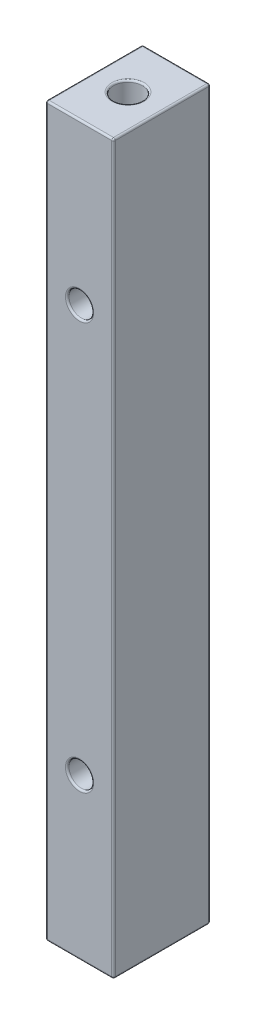
ISO-10303-21;
HEADER;
FILE_DESCRIPTION(('STEP AP214'),'2;1');
FILE_NAME('part.step','',(''),(''),'','','');
FILE_SCHEMA(('AUTOMOTIVE_DESIGN { 1 0 10303 214 1 1 1 1 }'));
ENDSEC;
DATA;
#1=APPLICATION_CONTEXT('core data for automotive mechanical design processes');
#2=APPLICATION_PROTOCOL_DEFINITION('international standard','automotive_design',2000,#1);
#3=PRODUCT_CONTEXT('',#1,'mechanical');
#4=PRODUCT('Part','Part','',(#3));
#5=PRODUCT_RELATED_PRODUCT_CATEGORY('part','',(#4));
#6=PRODUCT_DEFINITION_FORMATION('','',#4);
#7=PRODUCT_DEFINITION_CONTEXT('part definition',#1,'design');
#8=PRODUCT_DEFINITION('design','',#6,#7);
#9=PRODUCT_DEFINITION_SHAPE('','',#8);
#10=(LENGTH_UNIT() NAMED_UNIT(*) SI_UNIT(.MILLI.,.METRE.));
#11=(NAMED_UNIT(*) PLANE_ANGLE_UNIT() SI_UNIT($,.RADIAN.));
#12=(NAMED_UNIT(*) SI_UNIT($,.STERADIAN.) SOLID_ANGLE_UNIT());
#13=UNCERTAINTY_MEASURE_WITH_UNIT(LENGTH_MEASURE(1.E-05),#10,'distance_accuracy_value','');
#14=(GEOMETRIC_REPRESENTATION_CONTEXT(3) GLOBAL_UNCERTAINTY_ASSIGNED_CONTEXT((#13)) GLOBAL_UNIT_ASSIGNED_CONTEXT((#10,
#11,#12)) REPRESENTATION_CONTEXT('',''));
#15=CARTESIAN_POINT('',(0.,0.,0.));
#16=DIRECTION('',(0.,0.,1.));
#17=DIRECTION('',(1.,0.,0.));
#18=AXIS2_PLACEMENT_3D('',#15,#16,#17);
#19=CARTESIAN_POINT('',(0.,51.054,0.));
#20=DIRECTION('',(0.,-1.,0.));
#21=DIRECTION('',(0.,0.,-1.));
#22=AXIS2_PLACEMENT_3D('',#19,#20,#21);
#23=CYLINDRICAL_SURFACE('',#22,2.0193);
#24=CARTESIAN_POINT('',(0.,-50.8,0.));
#25=DIRECTION('',(0.,1.,0.));
#26=DIRECTION('',(0.,0.,1.));
#27=AXIS2_PLACEMENT_3D('',#24,#25,#26);
#28=CIRCLE('',#27,2.0193);
#29=CARTESIAN_POINT('',(0.,-50.8,2.0193));
#30=VERTEX_POINT('',#29);
#31=EDGE_CURVE('E44',#30,#30,#28,.F.);
#32=ORIENTED_EDGE('',*,*,#31,.T.);
#33=EDGE_LOOP('',(#32));
#34=FACE_BOUND('',#33,.T.);
#35=CARTESIAN_POINT('',(0.,-38.354,0.));
#36=DIRECTION('',(0.,1.,0.));
#37=DIRECTION('',(0.,0.,1.));
#38=AXIS2_PLACEMENT_3D('',#35,#36,#37);
#39=CIRCLE('',#38,2.0193);
#40=CARTESIAN_POINT('',(0.,-38.354,2.0193));
#41=VERTEX_POINT('',#40);
#42=EDGE_CURVE('E294',#41,#41,#39,.F.);
#43=ORIENTED_EDGE('',*,*,#42,.F.);
#44=EDGE_LOOP('',(#43));
#45=FACE_BOUND('',#44,.T.);
#46=ADVANCED_FACE('F35',(#34,#45),#23,.F.);
#47=CARTESIAN_POINT('',(0.,51.054,0.));
#48=DIRECTION('',(0.,1.,0.));
#49=DIRECTION('',(0.,0.,1.));
#50=AXIS2_PLACEMENT_3D('',#47,#48,#49);
#51=PLANE('',#50);
#52=DIRECTION('',(0.,0.,1.));
#53=VECTOR('',#52,1.);
#54=CARTESIAN_POINT('',(-4.5085,51.054,6.79958));
#55=LINE('',#54,#53);
#56=CARTESIAN_POINT('',(-4.5085,51.054,-6.54558));
#57=VERTEX_POINT('',#56);
#58=CARTESIAN_POINT('',(-4.5085,51.054,6.54558));
#59=VERTEX_POINT('',#58);
#60=EDGE_CURVE('E137',#57,#59,#55,.T.);
#61=ORIENTED_EDGE('',*,*,#60,.T.);
#62=DIRECTION('',(1.,0.,0.));
#63=VECTOR('',#62,1.);
#64=CARTESIAN_POINT('',(4.7625,51.054,6.54558));
#65=LINE('',#64,#63);
#66=CARTESIAN_POINT('',(4.5085,51.054,6.54558));
#67=VERTEX_POINT('',#66);
#68=EDGE_CURVE('E133',#59,#67,#65,.T.);
#69=ORIENTED_EDGE('',*,*,#68,.T.);
#70=DIRECTION('',(0.,0.,-1.));
#71=VECTOR('',#70,1.);
#72=CARTESIAN_POINT('',(4.5085,51.054,-6.79958));
#73=LINE('',#72,#71);
#74=CARTESIAN_POINT('',(4.5085,51.054,-6.54558));
#75=VERTEX_POINT('',#74);
#76=EDGE_CURVE('E124',#67,#75,#73,.T.);
#77=ORIENTED_EDGE('',*,*,#76,.T.);
#78=DIRECTION('',(-1.,0.,0.));
#79=VECTOR('',#78,1.);
#80=CARTESIAN_POINT('',(-4.7625,51.054,-6.54558));
#81=LINE('',#80,#79);
#82=EDGE_CURVE('E130',#75,#57,#81,.T.);
#83=ORIENTED_EDGE('',*,*,#82,.T.);
#84=EDGE_LOOP('',(#61,#69,#77,#83));
#85=FACE_BOUND('',#84,.T.);
#86=CARTESIAN_POINT('',(0.,51.054,0.));
#87=DIRECTION('',(0.,1.,0.));
#88=DIRECTION('',(0.,0.,1.));
#89=AXIS2_PLACEMENT_3D('',#86,#87,#88);
#90=CIRCLE('',#89,2.2733);
#91=CARTESIAN_POINT('',(0.,51.054,2.2733));
#92=VERTEX_POINT('',#91);
#93=EDGE_CURVE('E163',#92,#92,#90,.F.);
#94=ORIENTED_EDGE('',*,*,#93,.T.);
#95=EDGE_LOOP('',(#94));
#96=FACE_BOUND('',#95,.T.);
#97=ADVANCED_FACE('F127',(#85,#96),#51,.T.);
#98=CARTESIAN_POINT('',(0.,-51.054,0.));
#99=DIRECTION('',(0.,1.,0.));
#100=DIRECTION('',(0.,0.,1.));
#101=AXIS2_PLACEMENT_3D('',#98,#99,#100);
#102=PLANE('',#101);
#103=DIRECTION('',(0.,0.,-1.));
#104=VECTOR('',#103,1.);
#105=CARTESIAN_POINT('',(4.5085,-51.054,0.));
#106=LINE('',#105,#104);
#107=CARTESIAN_POINT('',(4.5085,-51.054,-6.54558));
#108=VERTEX_POINT('',#107);
#109=CARTESIAN_POINT('',(4.5085,-51.054,6.54558));
#110=VERTEX_POINT('',#109);
#111=EDGE_CURVE('E186',#108,#110,#106,.F.);
#112=ORIENTED_EDGE('',*,*,#111,.T.);
#113=DIRECTION('',(1.,0.,0.));
#114=VECTOR('',#113,1.);
#115=CARTESIAN_POINT('',(0.,-51.054,6.54558));
#116=LINE('',#115,#114);
#117=CARTESIAN_POINT('',(-4.5085,-51.054,6.54558));
#118=VERTEX_POINT('',#117);
#119=EDGE_CURVE('E191',#110,#118,#116,.F.);
#120=ORIENTED_EDGE('',*,*,#119,.T.);
#121=DIRECTION('',(0.,0.,1.));
#122=VECTOR('',#121,1.);
#123=CARTESIAN_POINT('',(-4.5085,-51.054,0.));
#124=LINE('',#123,#122);
#125=CARTESIAN_POINT('',(-4.5085,-51.054,-6.54558));
#126=VERTEX_POINT('',#125);
#127=EDGE_CURVE('E188',#118,#126,#124,.F.);
#128=ORIENTED_EDGE('',*,*,#127,.T.);
#129=DIRECTION('',(-1.,0.,0.));
#130=VECTOR('',#129,1.);
#131=CARTESIAN_POINT('',(0.,-51.054,-6.54558));
#132=LINE('',#131,#130);
#133=EDGE_CURVE('E184',#126,#108,#132,.F.);
#134=ORIENTED_EDGE('',*,*,#133,.T.);
#135=EDGE_LOOP('',(#112,#120,#128,#134));
#136=FACE_BOUND('',#135,.T.);
#137=CARTESIAN_POINT('',(0.,-51.054,0.));
#138=DIRECTION('',(0.,1.,0.));
#139=DIRECTION('',(0.,0.,1.));
#140=AXIS2_PLACEMENT_3D('',#137,#138,#139);
#141=CIRCLE('',#140,2.2733);
#142=CARTESIAN_POINT('',(0.,-51.054,2.2733));
#143=VERTEX_POINT('',#142);
#144=EDGE_CURVE('E181',#143,#143,#141,.T.);
#145=ORIENTED_EDGE('',*,*,#144,.T.);
#146=EDGE_LOOP('',(#145));
#147=FACE_BOUND('',#146,.T.);
#148=ADVANCED_FACE('F329',(#136,#147),#102,.F.);
#149=CARTESIAN_POINT('',(4.7625,51.054,6.79958));
#150=DIRECTION('',(-1.,0.,0.));
#151=DIRECTION('',(0.,0.,1.));
#152=AXIS2_PLACEMENT_3D('',#149,#150,#151);
#153=PLANE('',#152);
#154=DIRECTION('',(0.,0.,-1.));
#155=VECTOR('',#154,1.);
#156=CARTESIAN_POINT('',(4.7625,50.8,6.79958));
#157=LINE('',#156,#155);
#158=CARTESIAN_POINT('',(4.7625,50.8,-6.54558));
#159=VERTEX_POINT('',#158);
#160=CARTESIAN_POINT('',(4.7625,50.8,6.54558));
#161=VERTEX_POINT('',#160);
#162=EDGE_CURVE('E145',#159,#161,#157,.F.);
#163=ORIENTED_EDGE('',*,*,#162,.T.);
#164=DIRECTION('',(0.,-1.,0.));
#165=VECTOR('',#164,1.);
#166=CARTESIAN_POINT('',(4.7625,51.054,6.54558));
#167=LINE('',#166,#165);
#168=CARTESIAN_POINT('',(4.7625,-50.8,6.54558));
#169=VERTEX_POINT('',#168);
#170=EDGE_CURVE('E198',#161,#169,#167,.T.);
#171=ORIENTED_EDGE('',*,*,#170,.T.);
#172=DIRECTION('',(0.,0.,-1.));
#173=VECTOR('',#172,1.);
#174=CARTESIAN_POINT('',(4.7625,-50.8,6.79958));
#175=LINE('',#174,#173);
#176=CARTESIAN_POINT('',(4.7625,-50.8,-6.54558));
#177=VERTEX_POINT('',#176);
#178=EDGE_CURVE('E195',#169,#177,#175,.T.);
#179=ORIENTED_EDGE('',*,*,#178,.T.);
#180=DIRECTION('',(0.,-1.,0.));
#181=VECTOR('',#180,1.);
#182=CARTESIAN_POINT('',(4.7625,51.054,-6.54558));
#183=LINE('',#182,#181);
#184=EDGE_CURVE('E193',#177,#159,#183,.F.);
#185=ORIENTED_EDGE('',*,*,#184,.T.);
#186=EDGE_LOOP('',(#163,#171,#179,#185));
#187=FACE_BOUND('',#186,.T.);
#188=ADVANCED_FACE('F340',(#187),#153,.F.);
#189=CARTESIAN_POINT('',(4.7625,51.054,-6.79958));
#190=DIRECTION('',(0.,0.,1.));
#191=DIRECTION('',(1.,0.,0.));
#192=AXIS2_PLACEMENT_3D('',#189,#190,#191);
#193=PLANE('',#192);
#194=DIRECTION('',(-1.,0.,0.));
#195=VECTOR('',#194,1.);
#196=CARTESIAN_POINT('',(4.7625,50.8,-6.79958));
#197=LINE('',#196,#195);
#198=CARTESIAN_POINT('',(-4.5085,50.8,-6.79958));
#199=VERTEX_POINT('',#198);
#200=CARTESIAN_POINT('',(4.5085,50.8,-6.79958));
#201=VERTEX_POINT('',#200);
#202=EDGE_CURVE('E52',#199,#201,#197,.F.);
#203=ORIENTED_EDGE('',*,*,#202,.T.);
#204=DIRECTION('',(0.,-1.,0.));
#205=VECTOR('',#204,1.);
#206=CARTESIAN_POINT('',(4.5085,51.054,-6.79958));
#207=LINE('',#206,#205);
#208=CARTESIAN_POINT('',(4.5085,-50.8,-6.79958));
#209=VERTEX_POINT('',#208);
#210=EDGE_CURVE('E237',#201,#209,#207,.T.);
#211=ORIENTED_EDGE('',*,*,#210,.T.);
#212=DIRECTION('',(-1.,0.,0.));
#213=VECTOR('',#212,1.);
#214=CARTESIAN_POINT('',(4.7625,-50.8,-6.79958));
#215=LINE('',#214,#213);
#216=CARTESIAN_POINT('',(-4.5085,-50.8,-6.79958));
#217=VERTEX_POINT('',#216);
#218=EDGE_CURVE('E233',#209,#217,#215,.T.);
#219=ORIENTED_EDGE('',*,*,#218,.T.);
#220=DIRECTION('',(0.,-1.,0.));
#221=VECTOR('',#220,1.);
#222=CARTESIAN_POINT('',(-4.5085,51.054,-6.79958));
#223=LINE('',#222,#221);
#224=EDGE_CURVE('E57',#217,#199,#223,.F.);
#225=ORIENTED_EDGE('',*,*,#224,.T.);
#226=EDGE_LOOP('',(#203,#211,#219,#225));
#227=FACE_BOUND('',#226,.T.);
#228=CARTESIAN_POINT('',(0.,-28.575,-6.79958));
#229=DIRECTION('',(0.,0.,1.));
#230=DIRECTION('',(1.,0.,0.));
#231=AXIS2_PLACEMENT_3D('',#228,#229,#230);
#232=CIRCLE('',#231,1.9812);
#233=CARTESIAN_POINT('',(1.9812,-28.575,-6.79958));
#234=VERTEX_POINT('',#233);
#235=EDGE_CURVE('E230',#234,#234,#232,.T.);
#236=ORIENTED_EDGE('',*,*,#235,.T.);
#237=EDGE_LOOP('',(#236));
#238=FACE_BOUND('',#237,.T.);
#239=CARTESIAN_POINT('',(0.,28.575,-6.79958));
#240=DIRECTION('',(0.,0.,1.));
#241=DIRECTION('',(1.,0.,0.));
#242=AXIS2_PLACEMENT_3D('',#239,#240,#241);
#243=CIRCLE('',#242,1.9812);
#244=CARTESIAN_POINT('',(1.98120000000001,28.575,-6.79958));
#245=VERTEX_POINT('',#244);
#246=EDGE_CURVE('E227',#245,#245,#243,.T.);
#247=ORIENTED_EDGE('',*,*,#246,.T.);
#248=EDGE_LOOP('',(#247));
#249=FACE_BOUND('',#248,.T.);
#250=ADVANCED_FACE('F346',(#227,#238,#249),#193,.F.);
#251=CARTESIAN_POINT('',(-4.7625,51.054,6.79958));
#252=DIRECTION('',(1.,0.,0.));
#253=DIRECTION('',(0.,0.,-1.));
#254=AXIS2_PLACEMENT_3D('',#251,#252,#253);
#255=PLANE('',#254);
#256=DIRECTION('',(0.,0.,1.));
#257=VECTOR('',#256,1.);
#258=CARTESIAN_POINT('',(-4.7625,-50.8,6.79958));
#259=LINE('',#258,#257);
#260=CARTESIAN_POINT('',(-4.7625,-50.8,-6.54558));
#261=VERTEX_POINT('',#260);
#262=CARTESIAN_POINT('',(-4.7625,-50.8,6.54558));
#263=VERTEX_POINT('',#262);
#264=EDGE_CURVE('E174',#261,#263,#259,.T.);
#265=ORIENTED_EDGE('',*,*,#264,.T.);
#266=DIRECTION('',(0.,-1.,0.));
#267=VECTOR('',#266,1.);
#268=CARTESIAN_POINT('',(-4.7625,51.054,6.54558));
#269=LINE('',#268,#267);
#270=CARTESIAN_POINT('',(-4.7625,50.8,6.54558));
#271=VERTEX_POINT('',#270);
#272=EDGE_CURVE('E179',#263,#271,#269,.F.);
#273=ORIENTED_EDGE('',*,*,#272,.T.);
#274=DIRECTION('',(0.,0.,1.));
#275=VECTOR('',#274,1.);
#276=CARTESIAN_POINT('',(-4.7625,50.8,-6.79958));
#277=LINE('',#276,#275);
#278=CARTESIAN_POINT('',(-4.7625,50.8,-6.54558));
#279=VERTEX_POINT('',#278);
#280=EDGE_CURVE('E176',#271,#279,#277,.F.);
#281=ORIENTED_EDGE('',*,*,#280,.T.);
#282=DIRECTION('',(0.,-1.,0.));
#283=VECTOR('',#282,1.);
#284=CARTESIAN_POINT('',(-4.7625,51.054,-6.54558));
#285=LINE('',#284,#283);
#286=EDGE_CURVE('E172',#279,#261,#285,.T.);
#287=ORIENTED_EDGE('',*,*,#286,.T.);
#288=EDGE_LOOP('',(#265,#273,#281,#287));
#289=FACE_BOUND('',#288,.T.);
#290=ADVANCED_FACE('F319',(#289),#255,.F.);
#291=CARTESIAN_POINT('',(4.7625,51.054,6.79958));
#292=DIRECTION('',(0.,0.,-1.));
#293=DIRECTION('',(-1.,0.,0.));
#294=AXIS2_PLACEMENT_3D('',#291,#292,#293);
#295=PLANE('',#294);
#296=DIRECTION('',(1.,0.,0.));
#297=VECTOR('',#296,1.);
#298=CARTESIAN_POINT('',(-4.7625,50.8,6.79958));
#299=LINE('',#298,#297);
#300=CARTESIAN_POINT('',(4.5085,50.8,6.79958));
#301=VERTEX_POINT('',#300);
#302=CARTESIAN_POINT('',(-4.5085,50.8,6.79958));
#303=VERTEX_POINT('',#302);
#304=EDGE_CURVE('E210',#301,#303,#299,.F.);
#305=ORIENTED_EDGE('',*,*,#304,.T.);
#306=DIRECTION('',(0.,-1.,0.));
#307=VECTOR('',#306,1.);
#308=CARTESIAN_POINT('',(-4.5085,51.054,6.79958));
#309=LINE('',#308,#307);
#310=CARTESIAN_POINT('',(-4.5085,-50.8,6.79958));
#311=VERTEX_POINT('',#310);
#312=EDGE_CURVE('E212',#303,#311,#309,.T.);
#313=ORIENTED_EDGE('',*,*,#312,.T.);
#314=DIRECTION('',(1.,0.,0.));
#315=VECTOR('',#314,1.);
#316=CARTESIAN_POINT('',(4.7625,-50.8,6.79958));
#317=LINE('',#316,#315);
#318=CARTESIAN_POINT('',(4.5085,-50.8,6.79958));
#319=VERTEX_POINT('',#318);
#320=EDGE_CURVE('E206',#311,#319,#317,.T.);
#321=ORIENTED_EDGE('',*,*,#320,.T.);
#322=DIRECTION('',(0.,-1.,0.));
#323=VECTOR('',#322,1.);
#324=CARTESIAN_POINT('',(4.5085,51.054,6.79958));
#325=LINE('',#324,#323);
#326=EDGE_CURVE('E208',#319,#301,#325,.F.);
#327=ORIENTED_EDGE('',*,*,#326,.T.);
#328=EDGE_LOOP('',(#305,#313,#321,#327));
#329=FACE_BOUND('',#328,.T.);
#330=CARTESIAN_POINT('',(0.,-28.575,6.79958));
#331=DIRECTION('',(0.,0.,-1.));
#332=DIRECTION('',(-1.,0.,0.));
#333=AXIS2_PLACEMENT_3D('',#330,#331,#332);
#334=CIRCLE('',#333,1.9812);
#335=CARTESIAN_POINT('',(-1.9812,-28.575,6.79958));
#336=VERTEX_POINT('',#335);
#337=EDGE_CURVE('E203',#336,#336,#334,.T.);
#338=ORIENTED_EDGE('',*,*,#337,.T.);
#339=EDGE_LOOP('',(#338));
#340=FACE_BOUND('',#339,.T.);
#341=CARTESIAN_POINT('',(0.,28.575,6.79958));
#342=DIRECTION('',(0.,0.,-1.));
#343=DIRECTION('',(-1.,0.,0.));
#344=AXIS2_PLACEMENT_3D('',#341,#342,#343);
#345=CIRCLE('',#344,1.9812);
#346=CARTESIAN_POINT('',(-1.98119999999999,28.575,6.79958));
#347=VERTEX_POINT('',#346);
#348=EDGE_CURVE('E200',#347,#347,#345,.T.);
#349=ORIENTED_EDGE('',*,*,#348,.T.);
#350=EDGE_LOOP('',(#349));
#351=FACE_BOUND('',#350,.T.);
#352=ADVANCED_FACE('F311',(#329,#340,#351),#295,.F.);
#353=CARTESIAN_POINT('',(0.,50.8,0.));
#354=DIRECTION('',(0.,1.,0.));
#355=DIRECTION('',(0.,0.,1.));
#356=AXIS2_PLACEMENT_3D('',#353,#354,#355);
#357=CIRCLE('',#356,2.0193);
#358=CARTESIAN_POINT('',(0.,50.8,2.0193));
#359=VERTEX_POINT('',#358);
#360=EDGE_CURVE('E12',#359,#359,#357,.T.);
#361=ORIENTED_EDGE('',*,*,#360,.T.);
#362=EDGE_LOOP('',(#361));
#363=FACE_BOUND('',#362,.T.);
#364=CARTESIAN_POINT('',(0.,38.354,0.));
#365=DIRECTION('',(0.,1.,0.));
#366=DIRECTION('',(0.,0.,1.));
#367=AXIS2_PLACEMENT_3D('',#364,#365,#366);
#368=CIRCLE('',#367,2.0193);
#369=CARTESIAN_POINT('',(0.,38.354,2.0193));
#370=VERTEX_POINT('',#369);
#371=EDGE_CURVE('E166',#370,#370,#368,.T.);
#372=ORIENTED_EDGE('',*,*,#371,.F.);
#373=EDGE_LOOP('',(#372));
#374=FACE_BOUND('',#373,.T.);
#375=ADVANCED_FACE('F308',(#363,#374),#23,.F.);
#376=CARTESIAN_POINT('',(0.,-38.354,0.));
#377=DIRECTION('',(0.,1.,0.));
#378=DIRECTION('',(0.,0.,1.));
#379=AXIS2_PLACEMENT_3D('',#376,#377,#378);
#380=PLANE('',#379);
#381=ORIENTED_EDGE('',*,*,#42,.T.);
#382=EDGE_LOOP('',(#381));
#383=FACE_BOUND('',#382,.T.);
#384=ADVANCED_FACE('F310',(#383),#380,.F.);
#385=CARTESIAN_POINT('',(0.,38.354,0.));
#386=DIRECTION('',(0.,1.,0.));
#387=DIRECTION('',(0.,0.,1.));
#388=AXIS2_PLACEMENT_3D('',#385,#386,#387);
#389=PLANE('',#388);
#390=ORIENTED_EDGE('',*,*,#371,.T.);
#391=EDGE_LOOP('',(#390));
#392=FACE_BOUND('',#391,.T.);
#393=ADVANCED_FACE('F306',(#392),#389,.T.);
#394=CARTESIAN_POINT('',(0.,-28.575,11.6848393298616));
#395=DIRECTION('',(0.,0.,-1.));
#396=DIRECTION('',(-1.,0.,0.));
#397=AXIS2_PLACEMENT_3D('',#394,#395,#396);
#398=CYLINDRICAL_SURFACE('',#397,1.7272);
#399=CARTESIAN_POINT('',(0.,-28.575,6.54558));
#400=DIRECTION('',(0.,0.,-1.));
#401=DIRECTION('',(-1.,0.,0.));
#402=AXIS2_PLACEMENT_3D('',#399,#400,#401);
#403=CIRCLE('',#402,1.7272);
#404=CARTESIAN_POINT('',(-1.7272,-28.575,6.54558));
#405=VERTEX_POINT('',#404);
#406=EDGE_CURVE('E218',#405,#405,#403,.F.);
#407=ORIENTED_EDGE('',*,*,#406,.T.);
#408=EDGE_LOOP('',(#407));
#409=FACE_BOUND('',#408,.T.);
#410=CARTESIAN_POINT('',(0.,-28.575,-6.54558));
#411=DIRECTION('',(0.,0.,1.));
#412=DIRECTION('',(1.,0.,0.));
#413=AXIS2_PLACEMENT_3D('',#410,#411,#412);
#414=CIRCLE('',#413,1.7272);
#415=CARTESIAN_POINT('',(1.7272,-28.575,-6.54558));
#416=VERTEX_POINT('',#415);
#417=EDGE_CURVE('E215',#416,#416,#414,.F.);
#418=ORIENTED_EDGE('',*,*,#417,.T.);
#419=EDGE_LOOP('',(#418));
#420=FACE_BOUND('',#419,.T.);
#421=ADVANCED_FACE('F449',(#409,#420),#398,.F.);
#422=CARTESIAN_POINT('',(0.,28.575,11.6848393298616));
#423=DIRECTION('',(0.,0.,-1.));
#424=DIRECTION('',(-1.,0.,0.));
#425=AXIS2_PLACEMENT_3D('',#422,#423,#424);
#426=CYLINDRICAL_SURFACE('',#425,1.7272);
#427=CARTESIAN_POINT('',(0.,28.575,6.54558));
#428=DIRECTION('',(0.,0.,-1.));
#429=DIRECTION('',(-1.,0.,0.));
#430=AXIS2_PLACEMENT_3D('',#427,#428,#429);
#431=CIRCLE('',#430,1.7272);
#432=CARTESIAN_POINT('',(-1.72719999999999,28.575,6.54558));
#433=VERTEX_POINT('',#432);
#434=EDGE_CURVE('E224',#433,#433,#431,.F.);
#435=ORIENTED_EDGE('',*,*,#434,.T.);
#436=EDGE_LOOP('',(#435));
#437=FACE_BOUND('',#436,.T.);
#438=CARTESIAN_POINT('',(0.,28.575,-6.54558));
#439=DIRECTION('',(0.,0.,1.));
#440=DIRECTION('',(1.,0.,0.));
#441=AXIS2_PLACEMENT_3D('',#438,#439,#440);
#442=CIRCLE('',#441,1.7272);
#443=CARTESIAN_POINT('',(1.72720000000001,28.575,-6.54558));
#444=VERTEX_POINT('',#443);
#445=EDGE_CURVE('E221',#444,#444,#442,.F.);
#446=ORIENTED_EDGE('',*,*,#445,.T.);
#447=EDGE_LOOP('',(#446));
#448=FACE_BOUND('',#447,.T.);
#449=ADVANCED_FACE('F427',(#437,#448),#426,.F.);
#450=CARTESIAN_POINT('',(4.5085,-50.8,6.79958));
#451=DIRECTION('',(0.,0.,-1.));
#452=DIRECTION('',(-1.,0.,0.));
#453=AXIS2_PLACEMENT_3D('',#450,#451,#452);
#454=CYLINDRICAL_SURFACE('',#453,0.254);
#455=CARTESIAN_POINT('',(4.5085,-50.8,-6.54558));
#456=DIRECTION('',(0.,0.,-1.));
#457=DIRECTION('',(-1.,0.,0.));
#458=AXIS2_PLACEMENT_3D('',#455,#456,#457);
#459=CIRCLE('',#458,0.254);
#460=EDGE_CURVE('E39',#177,#108,#459,.T.);
#461=ORIENTED_EDGE('',*,*,#460,.F.);
#462=ORIENTED_EDGE('',*,*,#178,.F.);
#463=CARTESIAN_POINT('',(4.5085,-50.8,6.54558));
#464=DIRECTION('',(0.,0.,1.));
#465=DIRECTION('',(1.,0.,0.));
#466=AXIS2_PLACEMENT_3D('',#463,#464,#465);
#467=CIRCLE('',#466,0.254);
#468=EDGE_CURVE('E287',#110,#169,#467,.T.);
#469=ORIENTED_EDGE('',*,*,#468,.F.);
#470=ORIENTED_EDGE('',*,*,#111,.F.);
#471=EDGE_LOOP('',(#461,#462,#469,#470));
#472=FACE_BOUND('',#471,.T.);
#473=ADVANCED_FACE('F424',(#472),#454,.T.);
#474=CARTESIAN_POINT('',(4.5085,-50.8,-6.54558));
#475=DIRECTION('',(0.,0.,1.));
#476=DIRECTION('',(1.,0.,0.));
#477=AXIS2_PLACEMENT_3D('',#474,#475,#476);
#478=SPHERICAL_SURFACE('',#477,0.254);
#479=CARTESIAN_POINT('',(4.5085,-50.8,-6.54558));
#480=DIRECTION('',(0.,-1.,0.));
#481=DIRECTION('',(0.,0.,-1.));
#482=AXIS2_PLACEMENT_3D('',#479,#480,#481);
#483=CIRCLE('',#482,0.254);
#484=EDGE_CURVE('E282',#177,#209,#483,.F.);
#485=ORIENTED_EDGE('',*,*,#484,.F.);
#486=ORIENTED_EDGE('',*,*,#460,.T.);
#487=CARTESIAN_POINT('',(4.5085,-50.8,-6.54558));
#488=DIRECTION('',(1.,0.,0.));
#489=DIRECTION('',(0.,0.,-1.));
#490=AXIS2_PLACEMENT_3D('',#487,#488,#489);
#491=CIRCLE('',#490,0.254);
#492=EDGE_CURVE('E285',#209,#108,#491,.F.);
#493=ORIENTED_EDGE('',*,*,#492,.F.);
#494=EDGE_LOOP('',(#485,#486,#493));
#495=FACE_BOUND('',#494,.T.);
#496=ADVANCED_FACE('F421',(#495),#478,.T.);
#497=CARTESIAN_POINT('',(4.5085,-50.8,6.54558));
#498=DIRECTION('',(0.,0.,1.));
#499=DIRECTION('',(1.,0.,0.));
#500=AXIS2_PLACEMENT_3D('',#497,#498,#499);
#501=SPHERICAL_SURFACE('',#500,0.254);
#502=CARTESIAN_POINT('',(4.5085,-50.8,6.54558));
#503=DIRECTION('',(1.,0.,0.));
#504=DIRECTION('',(0.,0.,-1.));
#505=AXIS2_PLACEMENT_3D('',#502,#503,#504);
#506=CIRCLE('',#505,0.254);
#507=EDGE_CURVE('E276',#110,#319,#506,.F.);
#508=ORIENTED_EDGE('',*,*,#507,.F.);
#509=ORIENTED_EDGE('',*,*,#468,.T.);
#510=CARTESIAN_POINT('',(4.5085,-50.8,6.54558));
#511=DIRECTION('',(0.,-1.,0.));
#512=DIRECTION('',(0.,0.,-1.));
#513=AXIS2_PLACEMENT_3D('',#510,#511,#512);
#514=CIRCLE('',#513,0.254);
#515=EDGE_CURVE('E279',#319,#169,#514,.F.);
#516=ORIENTED_EDGE('',*,*,#515,.F.);
#517=EDGE_LOOP('',(#508,#509,#516));
#518=FACE_BOUND('',#517,.T.);
#519=ADVANCED_FACE('F417',(#518),#501,.T.);
#520=CARTESIAN_POINT('',(4.7625,-50.8,-6.54558));
#521=DIRECTION('',(-1.,0.,0.));
#522=DIRECTION('',(0.,0.,1.));
#523=AXIS2_PLACEMENT_3D('',#520,#521,#522);
#524=CYLINDRICAL_SURFACE('',#523,0.254);
#525=ORIENTED_EDGE('',*,*,#492,.T.);
#526=ORIENTED_EDGE('',*,*,#133,.F.);
#527=CARTESIAN_POINT('',(-4.5085,-50.8,-6.54558));
#528=DIRECTION('',(-1.,0.,0.));
#529=DIRECTION('',(0.,0.,1.));
#530=AXIS2_PLACEMENT_3D('',#527,#528,#529);
#531=CIRCLE('',#530,0.254);
#532=EDGE_CURVE('E271',#217,#126,#531,.T.);
#533=ORIENTED_EDGE('',*,*,#532,.F.);
#534=ORIENTED_EDGE('',*,*,#218,.F.);
#535=EDGE_LOOP('',(#525,#526,#533,#534));
#536=FACE_BOUND('',#535,.T.);
#537=ADVANCED_FACE('F413',(#536),#524,.T.);
#538=CARTESIAN_POINT('',(4.5085,51.054,-6.54558));
#539=DIRECTION('',(0.,-1.,0.));
#540=DIRECTION('',(0.,0.,-1.));
#541=AXIS2_PLACEMENT_3D('',#538,#539,#540);
#542=CYLINDRICAL_SURFACE('',#541,0.254);
#543=ORIENTED_EDGE('',*,*,#484,.T.);
#544=ORIENTED_EDGE('',*,*,#210,.F.);
#545=CARTESIAN_POINT('',(4.5085,50.8,-6.54558));
#546=DIRECTION('',(0.,1.,0.));
#547=DIRECTION('',(0.,0.,1.));
#548=AXIS2_PLACEMENT_3D('',#545,#546,#547);
#549=CIRCLE('',#548,0.254);
#550=EDGE_CURVE('E149',#159,#201,#549,.T.);
#551=ORIENTED_EDGE('',*,*,#550,.F.);
#552=ORIENTED_EDGE('',*,*,#184,.F.);
#553=EDGE_LOOP('',(#543,#544,#551,#552));
#554=FACE_BOUND('',#553,.T.);
#555=ADVANCED_FACE('F410',(#554),#542,.T.);
#556=CARTESIAN_POINT('',(4.5085,50.8,0.));
#557=DIRECTION('',(0.,0.,1.));
#558=DIRECTION('',(1.,0.,0.));
#559=AXIS2_PLACEMENT_3D('',#556,#557,#558);
#560=CYLINDRICAL_SURFACE('',#559,0.254);
#561=CARTESIAN_POINT('',(4.5085,50.8,6.54558));
#562=DIRECTION('',(0.,0.,1.));
#563=DIRECTION('',(1.,0.,0.));
#564=AXIS2_PLACEMENT_3D('',#561,#562,#563);
#565=CIRCLE('',#564,0.254);
#566=EDGE_CURVE('E150',#161,#67,#565,.T.);
#567=ORIENTED_EDGE('',*,*,#566,.F.);
#568=ORIENTED_EDGE('',*,*,#162,.F.);
#569=CARTESIAN_POINT('',(4.5085,50.8,-6.54558));
#570=DIRECTION('',(0.,0.,-1.));
#571=DIRECTION('',(-1.,0.,0.));
#572=AXIS2_PLACEMENT_3D('',#569,#570,#571);
#573=CIRCLE('',#572,0.254);
#574=EDGE_CURVE('E141',#75,#159,#573,.T.);
#575=ORIENTED_EDGE('',*,*,#574,.F.);
#576=ORIENTED_EDGE('',*,*,#76,.F.);
#577=EDGE_LOOP('',(#567,#568,#575,#576));
#578=FACE_BOUND('',#577,.T.);
#579=ADVANCED_FACE('F143',(#578),#560,.T.);
#580=CARTESIAN_POINT('',(4.5085,51.054,6.54558));
#581=DIRECTION('',(0.,-1.,0.));
#582=DIRECTION('',(0.,0.,-1.));
#583=AXIS2_PLACEMENT_3D('',#580,#581,#582);
#584=CYLINDRICAL_SURFACE('',#583,0.254);
#585=ORIENTED_EDGE('',*,*,#515,.T.);
#586=ORIENTED_EDGE('',*,*,#170,.F.);
#587=CARTESIAN_POINT('',(4.5085,50.8,6.54558));
#588=DIRECTION('',(0.,1.,0.));
#589=DIRECTION('',(0.,0.,1.));
#590=AXIS2_PLACEMENT_3D('',#587,#588,#589);
#591=CIRCLE('',#590,0.254);
#592=EDGE_CURVE('E267',#301,#161,#591,.T.);
#593=ORIENTED_EDGE('',*,*,#592,.F.);
#594=ORIENTED_EDGE('',*,*,#326,.F.);
#595=EDGE_LOOP('',(#585,#586,#593,#594));
#596=FACE_BOUND('',#595,.T.);
#597=ADVANCED_FACE('F403',(#596),#584,.T.);
#598=CARTESIAN_POINT('',(4.7625,-50.8,6.54558));
#599=DIRECTION('',(1.,0.,0.));
#600=DIRECTION('',(0.,0.,-1.));
#601=AXIS2_PLACEMENT_3D('',#598,#599,#600);
#602=CYLINDRICAL_SURFACE('',#601,0.254);
#603=ORIENTED_EDGE('',*,*,#507,.T.);
#604=ORIENTED_EDGE('',*,*,#320,.F.);
#605=CARTESIAN_POINT('',(-4.5085,-50.8,6.54558));
#606=DIRECTION('',(-1.,0.,0.));
#607=DIRECTION('',(0.,0.,1.));
#608=AXIS2_PLACEMENT_3D('',#605,#606,#607);
#609=CIRCLE('',#608,0.254);
#610=EDGE_CURVE('E264',#118,#311,#609,.T.);
#611=ORIENTED_EDGE('',*,*,#610,.F.);
#612=ORIENTED_EDGE('',*,*,#119,.F.);
#613=EDGE_LOOP('',(#603,#604,#611,#612));
#614=FACE_BOUND('',#613,.T.);
#615=ADVANCED_FACE('F399',(#614),#602,.T.);
#616=CARTESIAN_POINT('',(-4.5085,-50.8,6.79958));
#617=DIRECTION('',(0.,0.,1.));
#618=DIRECTION('',(1.,0.,0.));
#619=AXIS2_PLACEMENT_3D('',#616,#617,#618);
#620=CYLINDRICAL_SURFACE('',#619,0.254);
#621=CARTESIAN_POINT('',(-4.5085,-50.8,-6.54558));
#622=DIRECTION('',(0.,0.,-1.));
#623=DIRECTION('',(-1.,0.,0.));
#624=AXIS2_PLACEMENT_3D('',#621,#622,#623);
#625=CIRCLE('',#624,0.254);
#626=EDGE_CURVE('E273',#126,#261,#625,.T.);
#627=ORIENTED_EDGE('',*,*,#626,.F.);
#628=ORIENTED_EDGE('',*,*,#127,.F.);
#629=CARTESIAN_POINT('',(-4.5085,-50.8,6.54558));
#630=DIRECTION('',(0.,0.,1.));
#631=DIRECTION('',(1.,0.,0.));
#632=AXIS2_PLACEMENT_3D('',#629,#630,#631);
#633=CIRCLE('',#632,0.254);
#634=EDGE_CURVE('E261',#263,#118,#633,.T.);
#635=ORIENTED_EDGE('',*,*,#634,.F.);
#636=ORIENTED_EDGE('',*,*,#264,.F.);
#637=EDGE_LOOP('',(#627,#628,#635,#636));
#638=FACE_BOUND('',#637,.T.);
#639=ADVANCED_FACE('F395',(#638),#620,.T.);
#640=CARTESIAN_POINT('',(-4.5085,-50.8,-6.54558));
#641=DIRECTION('',(0.,0.,1.));
#642=DIRECTION('',(1.,0.,0.));
#643=AXIS2_PLACEMENT_3D('',#640,#641,#642);
#644=SPHERICAL_SURFACE('',#643,0.254);
#645=ORIENTED_EDGE('',*,*,#532,.T.);
#646=ORIENTED_EDGE('',*,*,#626,.T.);
#647=CARTESIAN_POINT('',(-4.5085,-50.8,-6.54558));
#648=DIRECTION('',(0.,-1.,0.));
#649=DIRECTION('',(0.,0.,-1.));
#650=AXIS2_PLACEMENT_3D('',#647,#648,#649);
#651=CIRCLE('',#650,0.254);
#652=EDGE_CURVE('E156',#217,#261,#651,.F.);
#653=ORIENTED_EDGE('',*,*,#652,.F.);
#654=EDGE_LOOP('',(#645,#646,#653));
#655=FACE_BOUND('',#654,.T.);
#656=ADVANCED_FACE('F392',(#655),#644,.T.);
#657=CARTESIAN_POINT('',(4.5085,50.8,-6.54558));
#658=DIRECTION('',(0.,0.,1.));
#659=DIRECTION('',(1.,0.,0.));
#660=AXIS2_PLACEMENT_3D('',#657,#658,#659);
#661=SPHERICAL_SURFACE('',#660,0.254);
#662=ORIENTED_EDGE('',*,*,#574,.T.);
#663=ORIENTED_EDGE('',*,*,#550,.T.);
#664=CARTESIAN_POINT('',(4.5085,50.8,-6.54558));
#665=DIRECTION('',(1.,0.,0.));
#666=DIRECTION('',(0.,0.,-1.));
#667=AXIS2_PLACEMENT_3D('',#664,#665,#666);
#668=CIRCLE('',#667,0.254);
#669=EDGE_CURVE('E153',#75,#201,#668,.F.);
#670=ORIENTED_EDGE('',*,*,#669,.F.);
#671=EDGE_LOOP('',(#662,#663,#670));
#672=FACE_BOUND('',#671,.T.);
#673=ADVANCED_FACE('F154',(#672),#661,.T.);
#674=CARTESIAN_POINT('',(4.5085,50.8,6.54558));
#675=DIRECTION('',(0.,0.,1.));
#676=DIRECTION('',(1.,0.,0.));
#677=AXIS2_PLACEMENT_3D('',#674,#675,#676);
#678=SPHERICAL_SURFACE('',#677,0.254);
#679=ORIENTED_EDGE('',*,*,#592,.T.);
#680=ORIENTED_EDGE('',*,*,#566,.T.);
#681=CARTESIAN_POINT('',(4.5085,50.8,6.54558));
#682=DIRECTION('',(1.,0.,0.));
#683=DIRECTION('',(0.,0.,-1.));
#684=AXIS2_PLACEMENT_3D('',#681,#682,#683);
#685=CIRCLE('',#684,0.254);
#686=EDGE_CURVE('E157',#301,#67,#685,.F.);
#687=ORIENTED_EDGE('',*,*,#686,.F.);
#688=EDGE_LOOP('',(#679,#680,#687));
#689=FACE_BOUND('',#688,.T.);
#690=ADVANCED_FACE('F385',(#689),#678,.T.);
#691=CARTESIAN_POINT('',(-4.5085,-50.8,6.54558));
#692=DIRECTION('',(0.,0.,1.));
#693=DIRECTION('',(1.,0.,0.));
#694=AXIS2_PLACEMENT_3D('',#691,#692,#693);
#695=SPHERICAL_SURFACE('',#694,0.254);
#696=ORIENTED_EDGE('',*,*,#634,.T.);
#697=ORIENTED_EDGE('',*,*,#610,.T.);
#698=CARTESIAN_POINT('',(-4.5085,-50.8,6.54558));
#699=DIRECTION('',(0.,-1.,0.));
#700=DIRECTION('',(0.,0.,-1.));
#701=AXIS2_PLACEMENT_3D('',#698,#699,#700);
#702=CIRCLE('',#701,0.254);
#703=EDGE_CURVE('E255',#263,#311,#702,.F.);
#704=ORIENTED_EDGE('',*,*,#703,.F.);
#705=EDGE_LOOP('',(#696,#697,#704));
#706=FACE_BOUND('',#705,.T.);
#707=ADVANCED_FACE('F381',(#706),#695,.T.);
#708=CARTESIAN_POINT('',(-4.5085,51.054,-6.54558));
#709=DIRECTION('',(0.,-1.,0.));
#710=DIRECTION('',(0.,0.,-1.));
#711=AXIS2_PLACEMENT_3D('',#708,#709,#710);
#712=CYLINDRICAL_SURFACE('',#711,0.254);
#713=ORIENTED_EDGE('',*,*,#652,.T.);
#714=ORIENTED_EDGE('',*,*,#286,.F.);
#715=CARTESIAN_POINT('',(-4.5085,50.8,-6.54558));
#716=DIRECTION('',(0.,1.,0.));
#717=DIRECTION('',(0.,0.,1.));
#718=AXIS2_PLACEMENT_3D('',#715,#716,#717);
#719=CIRCLE('',#718,0.254);
#720=EDGE_CURVE('E252',#199,#279,#719,.T.);
#721=ORIENTED_EDGE('',*,*,#720,.F.);
#722=ORIENTED_EDGE('',*,*,#224,.F.);
#723=EDGE_LOOP('',(#713,#714,#721,#722));
#724=FACE_BOUND('',#723,.T.);
#725=ADVANCED_FACE('F378',(#724),#712,.T.);
#726=CARTESIAN_POINT('',(0.,50.8,-6.54558));
#727=DIRECTION('',(1.,0.,0.));
#728=DIRECTION('',(0.,0.,-1.));
#729=AXIS2_PLACEMENT_3D('',#726,#727,#728);
#730=CYLINDRICAL_SURFACE('',#729,0.254);
#731=ORIENTED_EDGE('',*,*,#669,.T.);
#732=ORIENTED_EDGE('',*,*,#202,.F.);
#733=CARTESIAN_POINT('',(-4.5085,50.8,-6.54558));
#734=DIRECTION('',(-1.,0.,0.));
#735=DIRECTION('',(0.,0.,1.));
#736=AXIS2_PLACEMENT_3D('',#733,#734,#735);
#737=CIRCLE('',#736,0.254);
#738=EDGE_CURVE('E161',#57,#199,#737,.T.);
#739=ORIENTED_EDGE('',*,*,#738,.F.);
#740=ORIENTED_EDGE('',*,*,#82,.F.);
#741=EDGE_LOOP('',(#731,#732,#739,#740));
#742=FACE_BOUND('',#741,.T.);
#743=ADVANCED_FACE('F159',(#742),#730,.T.);
#744=CARTESIAN_POINT('',(0.,50.8,6.54558));
#745=DIRECTION('',(-1.,0.,0.));
#746=DIRECTION('',(0.,0.,1.));
#747=AXIS2_PLACEMENT_3D('',#744,#745,#746);
#748=CYLINDRICAL_SURFACE('',#747,0.254);
#749=ORIENTED_EDGE('',*,*,#686,.T.);
#750=ORIENTED_EDGE('',*,*,#68,.F.);
#751=CARTESIAN_POINT('',(-4.5085,50.8,6.54558));
#752=DIRECTION('',(-1.,0.,0.));
#753=DIRECTION('',(0.,-1.,0.));
#754=AXIS2_PLACEMENT_3D('',#751,#752,#753);
#755=CIRCLE('',#754,0.254);
#756=EDGE_CURVE('E248',#303,#59,#755,.T.);
#757=ORIENTED_EDGE('',*,*,#756,.F.);
#758=ORIENTED_EDGE('',*,*,#304,.F.);
#759=EDGE_LOOP('',(#749,#750,#757,#758));
#760=FACE_BOUND('',#759,.T.);
#761=ADVANCED_FACE('F371',(#760),#748,.T.);
#762=CARTESIAN_POINT('',(-4.5085,51.054,6.54558));
#763=DIRECTION('',(0.,-1.,0.));
#764=DIRECTION('',(0.,0.,-1.));
#765=AXIS2_PLACEMENT_3D('',#762,#763,#764);
#766=CYLINDRICAL_SURFACE('',#765,0.254);
#767=ORIENTED_EDGE('',*,*,#703,.T.);
#768=ORIENTED_EDGE('',*,*,#312,.F.);
#769=CARTESIAN_POINT('',(-4.5085,50.8,6.54558));
#770=DIRECTION('',(0.,1.,0.));
#771=DIRECTION('',(0.,0.,1.));
#772=AXIS2_PLACEMENT_3D('',#769,#770,#771);
#773=CIRCLE('',#772,0.254);
#774=EDGE_CURVE('E245',#271,#303,#773,.T.);
#775=ORIENTED_EDGE('',*,*,#774,.F.);
#776=ORIENTED_EDGE('',*,*,#272,.F.);
#777=EDGE_LOOP('',(#767,#768,#775,#776));
#778=FACE_BOUND('',#777,.T.);
#779=ADVANCED_FACE('F367',(#778),#766,.T.);
#780=CARTESIAN_POINT('',(-4.5085,50.8,-6.54558));
#781=DIRECTION('',(0.,0.,1.));
#782=DIRECTION('',(1.,0.,0.));
#783=AXIS2_PLACEMENT_3D('',#780,#781,#782);
#784=SPHERICAL_SURFACE('',#783,0.254);
#785=ORIENTED_EDGE('',*,*,#738,.T.);
#786=ORIENTED_EDGE('',*,*,#720,.T.);
#787=CARTESIAN_POINT('',(-4.5085,50.8,-6.54558));
#788=DIRECTION('',(0.,0.,-1.));
#789=DIRECTION('',(0.,1.,0.));
#790=AXIS2_PLACEMENT_3D('',#787,#788,#789);
#791=CIRCLE('',#790,0.254);
#792=EDGE_CURVE('E243',#57,#279,#791,.F.);
#793=ORIENTED_EDGE('',*,*,#792,.F.);
#794=EDGE_LOOP('',(#785,#786,#793));
#795=FACE_BOUND('',#794,.T.);
#796=ADVANCED_FACE('F363',(#795),#784,.T.);
#797=CARTESIAN_POINT('',(-4.5085,50.8,6.54558));
#798=DIRECTION('',(0.,0.,1.));
#799=DIRECTION('',(1.,0.,0.));
#800=AXIS2_PLACEMENT_3D('',#797,#798,#799);
#801=SPHERICAL_SURFACE('',#800,0.254);
#802=ORIENTED_EDGE('',*,*,#774,.T.);
#803=ORIENTED_EDGE('',*,*,#756,.T.);
#804=CARTESIAN_POINT('',(-4.5085,50.8,6.54558));
#805=DIRECTION('',(0.,0.,1.));
#806=DIRECTION('',(1.,0.,0.));
#807=AXIS2_PLACEMENT_3D('',#804,#805,#806);
#808=CIRCLE('',#807,0.254);
#809=EDGE_CURVE('E241',#271,#59,#808,.F.);
#810=ORIENTED_EDGE('',*,*,#809,.F.);
#811=EDGE_LOOP('',(#802,#803,#810));
#812=FACE_BOUND('',#811,.T.);
#813=ADVANCED_FACE('F359',(#812),#801,.T.);
#814=CARTESIAN_POINT('',(-4.5085,50.8,0.));
#815=DIRECTION('',(0.,0.,-1.));
#816=DIRECTION('',(-1.,0.,0.));
#817=AXIS2_PLACEMENT_3D('',#814,#815,#816);
#818=CYLINDRICAL_SURFACE('',#817,0.254);
#819=ORIENTED_EDGE('',*,*,#792,.T.);
#820=ORIENTED_EDGE('',*,*,#280,.F.);
#821=ORIENTED_EDGE('',*,*,#809,.T.);
#822=ORIENTED_EDGE('',*,*,#60,.F.);
#823=EDGE_LOOP('',(#819,#820,#821,#822));
#824=FACE_BOUND('',#823,.T.);
#825=ADVANCED_FACE('F355',(#824),#818,.T.);
#826=CARTESIAN_POINT('',(0.,-28.575,6.54558));
#827=DIRECTION('',(0.,0.,-1.));
#828=DIRECTION('',(-1.,0.,0.));
#829=AXIS2_PLACEMENT_3D('',#826,#827,#828);
#830=TOROIDAL_SURFACE('',#829,1.9812,0.254);
#831=ORIENTED_EDGE('',*,*,#337,.F.);
#832=EDGE_LOOP('',(#831));
#833=FACE_BOUND('',#832,.T.);
#834=ORIENTED_EDGE('',*,*,#406,.F.);
#835=EDGE_LOOP('',(#834));
#836=FACE_BOUND('',#835,.T.);
#837=ADVANCED_FACE('F358',(#833,#836),#830,.T.);
#838=CARTESIAN_POINT('',(0.,28.575,6.54558));
#839=DIRECTION('',(0.,0.,-1.));
#840=DIRECTION('',(-1.,0.,0.));
#841=AXIS2_PLACEMENT_3D('',#838,#839,#840);
#842=TOROIDAL_SURFACE('',#841,1.9812,0.254);
#843=ORIENTED_EDGE('',*,*,#348,.F.);
#844=EDGE_LOOP('',(#843));
#845=FACE_BOUND('',#844,.T.);
#846=ORIENTED_EDGE('',*,*,#434,.F.);
#847=EDGE_LOOP('',(#846));
#848=FACE_BOUND('',#847,.T.);
#849=ADVANCED_FACE('F431',(#845,#848),#842,.T.);
#850=CARTESIAN_POINT('',(0.,-28.575,-6.54558));
#851=DIRECTION('',(0.,0.,1.));
#852=DIRECTION('',(1.,0.,0.));
#853=AXIS2_PLACEMENT_3D('',#850,#851,#852);
#854=TOROIDAL_SURFACE('',#853,1.9812,0.254);
#855=ORIENTED_EDGE('',*,*,#235,.F.);
#856=EDGE_LOOP('',(#855));
#857=FACE_BOUND('',#856,.T.);
#858=ORIENTED_EDGE('',*,*,#417,.F.);
#859=EDGE_LOOP('',(#858));
#860=FACE_BOUND('',#859,.T.);
#861=ADVANCED_FACE('F435',(#857,#860),#854,.T.);
#862=CARTESIAN_POINT('',(0.,28.575,-6.54558));
#863=DIRECTION('',(0.,0.,1.));
#864=DIRECTION('',(1.,0.,0.));
#865=AXIS2_PLACEMENT_3D('',#862,#863,#864);
#866=TOROIDAL_SURFACE('',#865,1.9812,0.254);
#867=ORIENTED_EDGE('',*,*,#246,.F.);
#868=EDGE_LOOP('',(#867));
#869=FACE_BOUND('',#868,.T.);
#870=ORIENTED_EDGE('',*,*,#445,.F.);
#871=EDGE_LOOP('',(#870));
#872=FACE_BOUND('',#871,.T.);
#873=ADVANCED_FACE('F336',(#869,#872),#866,.T.);
#874=CARTESIAN_POINT('',(0.,-50.8,0.));
#875=DIRECTION('',(0.,1.,0.));
#876=DIRECTION('',(0.,0.,1.));
#877=AXIS2_PLACEMENT_3D('',#874,#875,#876);
#878=TOROIDAL_SURFACE('',#877,2.2733,0.254);
#879=ORIENTED_EDGE('',*,*,#31,.F.);
#880=EDGE_LOOP('',(#879));
#881=FACE_BOUND('',#880,.T.);
#882=ORIENTED_EDGE('',*,*,#144,.F.);
#883=EDGE_LOOP('',(#882));
#884=FACE_BOUND('',#883,.T.);
#885=ADVANCED_FACE('F333',(#881,#884),#878,.T.);
#886=CARTESIAN_POINT('',(0.,50.8,0.));
#887=DIRECTION('',(0.,1.,0.));
#888=DIRECTION('',(0.,0.,1.));
#889=AXIS2_PLACEMENT_3D('',#886,#887,#888);
#890=TOROIDAL_SURFACE('',#889,2.2733,0.254);
#891=ORIENTED_EDGE('',*,*,#93,.F.);
#892=EDGE_LOOP('',(#891));
#893=FACE_BOUND('',#892,.T.);
#894=ORIENTED_EDGE('',*,*,#360,.F.);
#895=EDGE_LOOP('',(#894));
#896=FACE_BOUND('',#895,.T.);
#897=ADVANCED_FACE('F37',(#893,#896),#890,.T.);
#898=CLOSED_SHELL('',(#46,#97,#148,#188,#250,#290,#352,#375,#384,#393,#421,#449,#473,#496,#519,
#537,#555,#579,#597,#615,#639,#656,#673,#690,#707,#725,#743,#761,#779,#796,#813,#825,#837,#849,
#861,#873,#885,#897));
#899=MANIFOLD_SOLID_BREP('B2',#898);
#900=ADVANCED_BREP_SHAPE_REPRESENTATION('',(#18,#899),#14);
#901=SHAPE_DEFINITION_REPRESENTATION(#9,#900);
ENDSEC;
END-ISO-10303-21;
